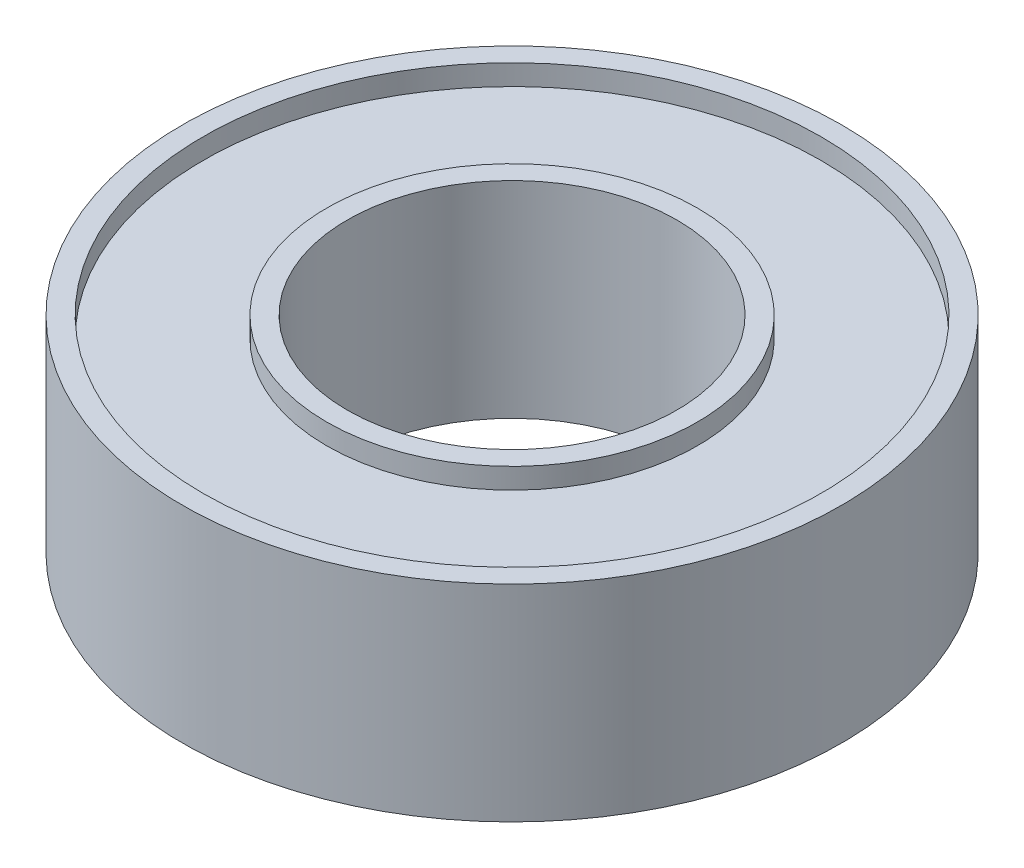
ISO-10303-21;
HEADER;
FILE_DESCRIPTION(('STEP AP214'),'2;1');
FILE_NAME('part.step','',(''),(''),'','','');
FILE_SCHEMA(('AUTOMOTIVE_DESIGN { 1 0 10303 214 1 1 1 1 }'));
ENDSEC;
DATA;
#1=APPLICATION_CONTEXT('core data for automotive mechanical design processes');
#2=APPLICATION_PROTOCOL_DEFINITION('international standard','automotive_design',2000,#1);
#3=PRODUCT_CONTEXT('',#1,'mechanical');
#4=PRODUCT('Part','Part','',(#3));
#5=PRODUCT_RELATED_PRODUCT_CATEGORY('part','',(#4));
#6=PRODUCT_DEFINITION_FORMATION('','',#4);
#7=PRODUCT_DEFINITION_CONTEXT('part definition',#1,'design');
#8=PRODUCT_DEFINITION('design','',#6,#7);
#9=PRODUCT_DEFINITION_SHAPE('','',#8);
#10=(LENGTH_UNIT() NAMED_UNIT(*) SI_UNIT(.MILLI.,.METRE.));
#11=(NAMED_UNIT(*) PLANE_ANGLE_UNIT() SI_UNIT($,.RADIAN.));
#12=(NAMED_UNIT(*) SI_UNIT($,.STERADIAN.) SOLID_ANGLE_UNIT());
#13=UNCERTAINTY_MEASURE_WITH_UNIT(LENGTH_MEASURE(1.E-05),#10,'distance_accuracy_value','');
#14=(GEOMETRIC_REPRESENTATION_CONTEXT(3) GLOBAL_UNCERTAINTY_ASSIGNED_CONTEXT((#13)) GLOBAL_UNIT_ASSIGNED_CONTEXT((#10,
#11,#12)) REPRESENTATION_CONTEXT('',''));
#15=CARTESIAN_POINT('',(0.,0.,0.));
#16=DIRECTION('',(0.,0.,1.));
#17=DIRECTION('',(1.,0.,0.));
#18=AXIS2_PLACEMENT_3D('',#15,#16,#17);
#19=CARTESIAN_POINT('',(0.,0.,0.));
#20=DIRECTION('',(0.,-1.,0.));
#21=DIRECTION('',(0.,0.,-1.));
#22=AXIS2_PLACEMENT_3D('',#19,#20,#21);
#23=CYLINDRICAL_SURFACE('',#22,4.);
#24=CARTESIAN_POINT('',(0.,4.5,0.));
#25=DIRECTION('',(0.,-1.,0.));
#26=DIRECTION('',(0.,0.,-1.));
#27=AXIS2_PLACEMENT_3D('',#24,#25,#26);
#28=CIRCLE('',#27,4.);
#29=CARTESIAN_POINT('',(0.,4.5,-4.));
#30=VERTEX_POINT('',#29);
#31=EDGE_CURVE('E10',#30,#30,#28,.T.);
#32=ORIENTED_EDGE('',*,*,#31,.F.);
#33=EDGE_LOOP('',(#32));
#34=FACE_BOUND('',#33,.T.);
#35=CARTESIAN_POINT('',(0.,-0.500000000000004,0.));
#36=DIRECTION('',(0.,-1.,0.));
#37=DIRECTION('',(0.,0.,-1.));
#38=AXIS2_PLACEMENT_3D('',#35,#36,#37);
#39=CIRCLE('',#38,4.);
#40=CARTESIAN_POINT('',(0.,-0.500000000000004,-4.));
#41=VERTEX_POINT('',#40);
#42=EDGE_CURVE('E76',#41,#41,#39,.T.);
#43=ORIENTED_EDGE('',*,*,#42,.T.);
#44=EDGE_LOOP('',(#43));
#45=FACE_BOUND('',#44,.T.);
#46=ADVANCED_FACE('F36',(#34,#45),#23,.F.);
#47=CARTESIAN_POINT('',(-4.,4.5,0.));
#48=DIRECTION('',(0.,-1.,0.));
#49=DIRECTION('',(0.,0.,-1.));
#50=AXIS2_PLACEMENT_3D('',#47,#48,#49);
#51=PLANE('',#50);
#52=CARTESIAN_POINT('',(0.,4.5,0.));
#53=DIRECTION('',(0.,-1.,0.));
#54=DIRECTION('',(0.,0.,-1.));
#55=AXIS2_PLACEMENT_3D('',#52,#53,#54);
#56=CIRCLE('',#55,4.5);
#57=CARTESIAN_POINT('',(0.,4.5,-4.5));
#58=VERTEX_POINT('',#57);
#59=EDGE_CURVE('E42',#58,#58,#56,.T.);
#60=ORIENTED_EDGE('',*,*,#59,.F.);
#61=EDGE_LOOP('',(#60));
#62=FACE_BOUND('',#61,.T.);
#63=ORIENTED_EDGE('',*,*,#31,.T.);
#64=EDGE_LOOP('',(#63));
#65=FACE_BOUND('',#64,.T.);
#66=ADVANCED_FACE('F137',(#62,#65),#51,.F.);
#67=CARTESIAN_POINT('',(0.,0.,0.));
#68=DIRECTION('',(0.,-1.,0.));
#69=DIRECTION('',(0.,0.,-1.));
#70=AXIS2_PLACEMENT_3D('',#67,#68,#69);
#71=CYLINDRICAL_SURFACE('',#70,4.5);
#72=CARTESIAN_POINT('',(0.,4.,0.));
#73=DIRECTION('',(0.,-1.,0.));
#74=DIRECTION('',(0.,0.,-1.));
#75=AXIS2_PLACEMENT_3D('',#72,#73,#74);
#76=CIRCLE('',#75,4.5);
#77=CARTESIAN_POINT('',(0.,4.,-4.5));
#78=VERTEX_POINT('',#77);
#79=EDGE_CURVE('E46',#78,#78,#76,.T.);
#80=ORIENTED_EDGE('',*,*,#79,.F.);
#81=EDGE_LOOP('',(#80));
#82=FACE_BOUND('',#81,.T.);
#83=ORIENTED_EDGE('',*,*,#59,.T.);
#84=EDGE_LOOP('',(#83));
#85=FACE_BOUND('',#84,.T.);
#86=ADVANCED_FACE('F132',(#82,#85),#71,.T.);
#87=CARTESIAN_POINT('',(-4.5,4.,0.));
#88=DIRECTION('',(0.,-1.,0.));
#89=DIRECTION('',(0.,0.,-1.));
#90=AXIS2_PLACEMENT_3D('',#87,#88,#89);
#91=PLANE('',#90);
#92=CARTESIAN_POINT('',(0.,4.,0.));
#93=DIRECTION('',(0.,-1.,0.));
#94=DIRECTION('',(0.,0.,-1.));
#95=AXIS2_PLACEMENT_3D('',#92,#93,#94);
#96=CIRCLE('',#95,7.5);
#97=CARTESIAN_POINT('',(0.,4.,-7.5));
#98=VERTEX_POINT('',#97);
#99=EDGE_CURVE('E50',#98,#98,#96,.T.);
#100=ORIENTED_EDGE('',*,*,#99,.F.);
#101=EDGE_LOOP('',(#100));
#102=FACE_BOUND('',#101,.T.);
#103=ORIENTED_EDGE('',*,*,#79,.T.);
#104=EDGE_LOOP('',(#103));
#105=FACE_BOUND('',#104,.T.);
#106=ADVANCED_FACE('F126',(#102,#105),#91,.F.);
#107=CARTESIAN_POINT('',(0.,0.,0.));
#108=DIRECTION('',(0.,-1.,0.));
#109=DIRECTION('',(0.,0.,-1.));
#110=AXIS2_PLACEMENT_3D('',#107,#108,#109);
#111=CYLINDRICAL_SURFACE('',#110,7.5);
#112=CARTESIAN_POINT('',(0.,4.5,0.));
#113=DIRECTION('',(0.,-1.,0.));
#114=DIRECTION('',(0.,0.,-1.));
#115=AXIS2_PLACEMENT_3D('',#112,#113,#114);
#116=CIRCLE('',#115,7.5);
#117=CARTESIAN_POINT('',(0.,4.5,-7.5));
#118=VERTEX_POINT('',#117);
#119=EDGE_CURVE('E55',#118,#118,#116,.T.);
#120=ORIENTED_EDGE('',*,*,#119,.F.);
#121=EDGE_LOOP('',(#120));
#122=FACE_BOUND('',#121,.T.);
#123=ORIENTED_EDGE('',*,*,#99,.T.);
#124=EDGE_LOOP('',(#123));
#125=FACE_BOUND('',#124,.T.);
#126=ADVANCED_FACE('F120',(#122,#125),#111,.F.);
#127=CARTESIAN_POINT('',(-7.5,4.5,0.));
#128=DIRECTION('',(0.,-1.,0.));
#129=DIRECTION('',(0.,0.,-1.));
#130=AXIS2_PLACEMENT_3D('',#127,#128,#129);
#131=PLANE('',#130);
#132=CARTESIAN_POINT('',(0.,4.5,0.));
#133=DIRECTION('',(0.,-1.,0.));
#134=DIRECTION('',(0.,0.,-1.));
#135=AXIS2_PLACEMENT_3D('',#132,#133,#134);
#136=CIRCLE('',#135,8.);
#137=CARTESIAN_POINT('',(0.,4.5,-8.));
#138=VERTEX_POINT('',#137);
#139=EDGE_CURVE('E58',#138,#138,#136,.T.);
#140=ORIENTED_EDGE('',*,*,#139,.F.);
#141=EDGE_LOOP('',(#140));
#142=FACE_BOUND('',#141,.T.);
#143=ORIENTED_EDGE('',*,*,#119,.T.);
#144=EDGE_LOOP('',(#143));
#145=FACE_BOUND('',#144,.T.);
#146=ADVANCED_FACE('F114',(#142,#145),#131,.F.);
#147=CARTESIAN_POINT('',(0.,0.,0.));
#148=DIRECTION('',(0.,-1.,0.));
#149=DIRECTION('',(0.,0.,-1.));
#150=AXIS2_PLACEMENT_3D('',#147,#148,#149);
#151=CYLINDRICAL_SURFACE('',#150,8.);
#152=CARTESIAN_POINT('',(0.,-0.500000000000004,0.));
#153=DIRECTION('',(0.,-1.,0.));
#154=DIRECTION('',(0.,0.,-1.));
#155=AXIS2_PLACEMENT_3D('',#152,#153,#154);
#156=CIRCLE('',#155,8.);
#157=CARTESIAN_POINT('',(0.,-0.500000000000004,-8.));
#158=VERTEX_POINT('',#157);
#159=EDGE_CURVE('E61',#158,#158,#156,.T.);
#160=ORIENTED_EDGE('',*,*,#159,.F.);
#161=EDGE_LOOP('',(#160));
#162=FACE_BOUND('',#161,.T.);
#163=ORIENTED_EDGE('',*,*,#139,.T.);
#164=EDGE_LOOP('',(#163));
#165=FACE_BOUND('',#164,.T.);
#166=ADVANCED_FACE('F108',(#162,#165),#151,.T.);
#167=CARTESIAN_POINT('',(-8.,-0.500000000000004,0.));
#168=DIRECTION('',(0.,1.,0.));
#169=DIRECTION('',(0.,0.,1.));
#170=AXIS2_PLACEMENT_3D('',#167,#168,#169);
#171=PLANE('',#170);
#172=CARTESIAN_POINT('',(0.,-0.500000000000004,0.));
#173=DIRECTION('',(0.,-1.,0.));
#174=DIRECTION('',(0.,0.,-1.));
#175=AXIS2_PLACEMENT_3D('',#172,#173,#174);
#176=CIRCLE('',#175,7.5);
#177=CARTESIAN_POINT('',(0.,-0.500000000000004,-7.5));
#178=VERTEX_POINT('',#177);
#179=EDGE_CURVE('E64',#178,#178,#176,.T.);
#180=ORIENTED_EDGE('',*,*,#179,.F.);
#181=EDGE_LOOP('',(#180));
#182=FACE_BOUND('',#181,.T.);
#183=ORIENTED_EDGE('',*,*,#159,.T.);
#184=EDGE_LOOP('',(#183));
#185=FACE_BOUND('',#184,.T.);
#186=ADVANCED_FACE('F102',(#182,#185),#171,.F.);
#187=CARTESIAN_POINT('',(0.,0.,0.));
#188=DIRECTION('',(0.,-1.,0.));
#189=DIRECTION('',(0.,0.,-1.));
#190=AXIS2_PLACEMENT_3D('',#187,#188,#189);
#191=CYLINDRICAL_SURFACE('',#190,7.5);
#192=CARTESIAN_POINT('',(0.,0.,0.));
#193=DIRECTION('',(0.,-1.,0.));
#194=DIRECTION('',(0.,0.,-1.));
#195=AXIS2_PLACEMENT_3D('',#192,#193,#194);
#196=CIRCLE('',#195,7.5);
#197=CARTESIAN_POINT('',(0.,0.,-7.5));
#198=VERTEX_POINT('',#197);
#199=EDGE_CURVE('E67',#198,#198,#196,.T.);
#200=ORIENTED_EDGE('',*,*,#199,.F.);
#201=EDGE_LOOP('',(#200));
#202=FACE_BOUND('',#201,.T.);
#203=ORIENTED_EDGE('',*,*,#179,.T.);
#204=EDGE_LOOP('',(#203));
#205=FACE_BOUND('',#204,.T.);
#206=ADVANCED_FACE('F96',(#202,#205),#191,.F.);
#207=CARTESIAN_POINT('',(-7.5,0.,0.));
#208=DIRECTION('',(0.,1.,0.));
#209=DIRECTION('',(0.,0.,1.));
#210=AXIS2_PLACEMENT_3D('',#207,#208,#209);
#211=PLANE('',#210);
#212=CARTESIAN_POINT('',(0.,0.,0.));
#213=DIRECTION('',(0.,-1.,0.));
#214=DIRECTION('',(0.,0.,-1.));
#215=AXIS2_PLACEMENT_3D('',#212,#213,#214);
#216=CIRCLE('',#215,4.5);
#217=CARTESIAN_POINT('',(0.,0.,-4.5));
#218=VERTEX_POINT('',#217);
#219=EDGE_CURVE('E70',#218,#218,#216,.T.);
#220=ORIENTED_EDGE('',*,*,#219,.F.);
#221=EDGE_LOOP('',(#220));
#222=FACE_BOUND('',#221,.T.);
#223=ORIENTED_EDGE('',*,*,#199,.T.);
#224=EDGE_LOOP('',(#223));
#225=FACE_BOUND('',#224,.T.);
#226=ADVANCED_FACE('F90',(#222,#225),#211,.F.);
#227=CARTESIAN_POINT('',(0.,0.,0.));
#228=DIRECTION('',(0.,-1.,0.));
#229=DIRECTION('',(0.,0.,-1.));
#230=AXIS2_PLACEMENT_3D('',#227,#228,#229);
#231=CYLINDRICAL_SURFACE('',#230,4.5);
#232=CARTESIAN_POINT('',(0.,-0.5,0.));
#233=DIRECTION('',(0.,-1.,0.));
#234=DIRECTION('',(0.,0.,-1.));
#235=AXIS2_PLACEMENT_3D('',#232,#233,#234);
#236=CIRCLE('',#235,4.5);
#237=CARTESIAN_POINT('',(0.,-0.5,-4.5));
#238=VERTEX_POINT('',#237);
#239=EDGE_CURVE('E73',#238,#238,#236,.T.);
#240=ORIENTED_EDGE('',*,*,#239,.F.);
#241=EDGE_LOOP('',(#240));
#242=FACE_BOUND('',#241,.T.);
#243=ORIENTED_EDGE('',*,*,#219,.T.);
#244=EDGE_LOOP('',(#243));
#245=FACE_BOUND('',#244,.T.);
#246=ADVANCED_FACE('F84',(#242,#245),#231,.T.);
#247=CARTESIAN_POINT('',(-4.5,-0.500000000000002,0.));
#248=DIRECTION('',(0.,1.,0.));
#249=DIRECTION('',(0.,0.,1.));
#250=AXIS2_PLACEMENT_3D('',#247,#248,#249);
#251=PLANE('',#250);
#252=ORIENTED_EDGE('',*,*,#42,.F.);
#253=EDGE_LOOP('',(#252));
#254=FACE_BOUND('',#253,.T.);
#255=ORIENTED_EDGE('',*,*,#239,.T.);
#256=EDGE_LOOP('',(#255));
#257=FACE_BOUND('',#256,.T.);
#258=ADVANCED_FACE('F81',(#254,#257),#251,.F.);
#259=CLOSED_SHELL('',(#46,#66,#86,#106,#126,#146,#166,#186,#206,#226,#246,#258));
#260=MANIFOLD_SOLID_BREP('B2',#259);
#261=ADVANCED_BREP_SHAPE_REPRESENTATION('',(#18,#260),#14);
#262=SHAPE_DEFINITION_REPRESENTATION(#9,#261);
ENDSEC;
END-ISO-10303-21;
